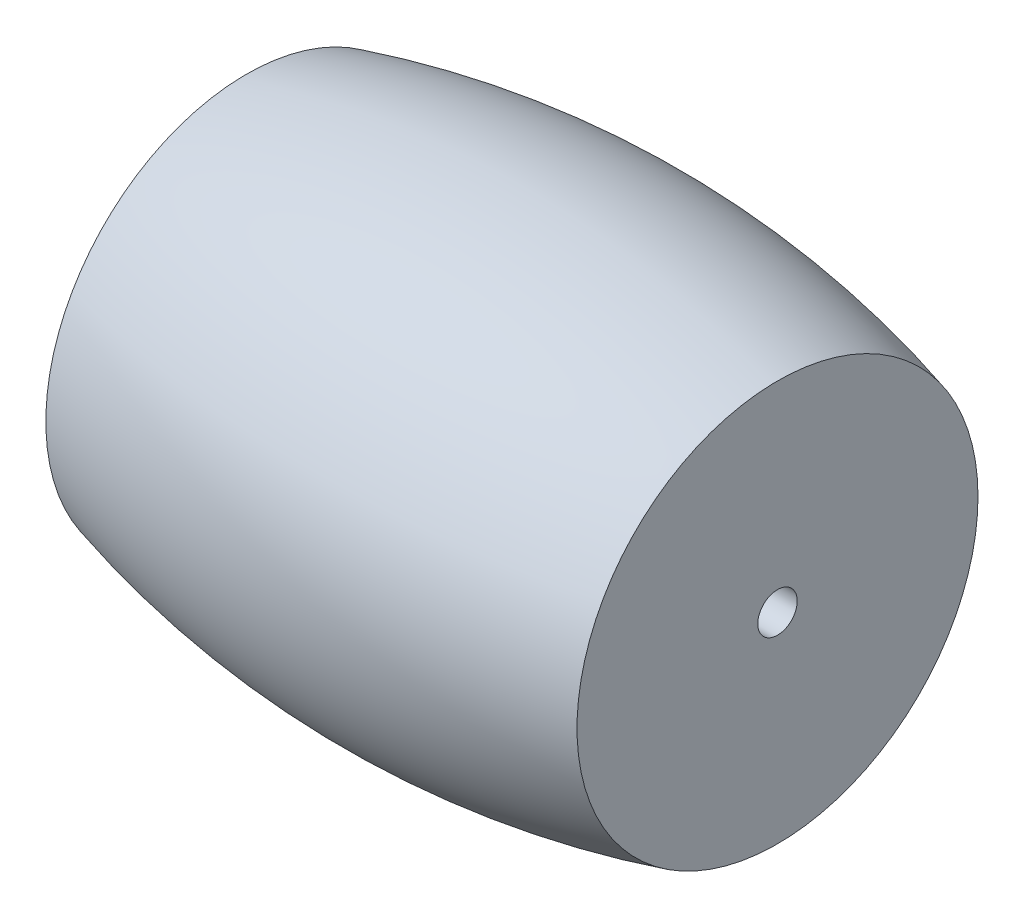
ISO-10303-21;
HEADER;
FILE_DESCRIPTION(('STEP AP214'),'2;1');
FILE_NAME('part.step','',(''),(''),'','','');
FILE_SCHEMA(('AUTOMOTIVE_DESIGN { 1 0 10303 214 1 1 1 1 }'));
ENDSEC;
DATA;
#1=APPLICATION_CONTEXT('core data for automotive mechanical design processes');
#2=APPLICATION_PROTOCOL_DEFINITION('international standard','automotive_design',2000,#1);
#3=PRODUCT_CONTEXT('',#1,'mechanical');
#4=PRODUCT('Part','Part','',(#3));
#5=PRODUCT_RELATED_PRODUCT_CATEGORY('part','',(#4));
#6=PRODUCT_DEFINITION_FORMATION('','',#4);
#7=PRODUCT_DEFINITION_CONTEXT('part definition',#1,'design');
#8=PRODUCT_DEFINITION('design','',#6,#7);
#9=PRODUCT_DEFINITION_SHAPE('','',#8);
#10=(LENGTH_UNIT() NAMED_UNIT(*) SI_UNIT(.MILLI.,.METRE.));
#11=(NAMED_UNIT(*) PLANE_ANGLE_UNIT() SI_UNIT($,.RADIAN.));
#12=(NAMED_UNIT(*) SI_UNIT($,.STERADIAN.) SOLID_ANGLE_UNIT());
#13=UNCERTAINTY_MEASURE_WITH_UNIT(LENGTH_MEASURE(1.E-05),#10,'distance_accuracy_value','');
#14=(GEOMETRIC_REPRESENTATION_CONTEXT(3) GLOBAL_UNCERTAINTY_ASSIGNED_CONTEXT((#13)) GLOBAL_UNIT_ASSIGNED_CONTEXT((#10,
#11,#12)) REPRESENTATION_CONTEXT('',''));
#15=CARTESIAN_POINT('',(0.,0.,0.));
#16=DIRECTION('',(0.,0.,1.));
#17=DIRECTION('',(1.,0.,0.));
#18=AXIS2_PLACEMENT_3D('',#15,#16,#17);
#19=CARTESIAN_POINT('',(27.9669614033673,0.,0.));
#20=DIRECTION('',(1.,0.,0.));
#21=DIRECTION('',(0.,0.,-1.));
#22=AXIS2_PLACEMENT_3D('',#19,#20,#21);
#23=CYLINDRICAL_SURFACE('',#22,1.24999999999999);
#24=CARTESIAN_POINT('',(16.8232379316637,0.,0.));
#25=DIRECTION('',(1.,0.,0.));
#26=DIRECTION('',(0.,0.,-1.));
#27=AXIS2_PLACEMENT_3D('',#24,#25,#26);
#28=CIRCLE('',#27,1.24999999999999);
#29=CARTESIAN_POINT('',(16.8232379316637,0.,-1.24999999999999));
#30=VERTEX_POINT('',#29);
#31=EDGE_CURVE('E10',#30,#30,#28,.T.);
#32=ORIENTED_EDGE('',*,*,#31,.T.);
#33=EDGE_LOOP('',(#32));
#34=FACE_BOUND('',#33,.T.);
#35=CARTESIAN_POINT('',(-16.8232379316637,0.,0.));
#36=DIRECTION('',(1.,0.,0.));
#37=DIRECTION('',(0.,0.,-1.));
#38=AXIS2_PLACEMENT_3D('',#35,#36,#37);
#39=CIRCLE('',#38,1.24999999999999);
#40=CARTESIAN_POINT('',(-16.8232379316637,0.,-1.24999999999999));
#41=VERTEX_POINT('',#40);
#42=EDGE_CURVE('E44',#41,#41,#39,.T.);
#43=ORIENTED_EDGE('',*,*,#42,.F.);
#44=EDGE_LOOP('',(#43));
#45=FACE_BOUND('',#44,.T.);
#46=ADVANCED_FACE('F30',(#34,#45),#23,.F.);
#47=CARTESIAN_POINT('',(16.8232379316637,12.7,0.));
#48=DIRECTION('',(1.,0.,0.));
#49=DIRECTION('',(0.,0.,-1.));
#50=AXIS2_PLACEMENT_3D('',#47,#48,#49);
#51=PLANE('',#50);
#52=CARTESIAN_POINT('',(16.8232379316637,0.,0.));
#53=DIRECTION('',(1.,0.,0.));
#54=DIRECTION('',(0.,0.,-1.));
#55=AXIS2_PLACEMENT_3D('',#52,#53,#54);
#56=CIRCLE('',#55,12.7);
#57=CARTESIAN_POINT('',(16.8232379316637,0.,-12.7));
#58=VERTEX_POINT('',#57);
#59=EDGE_CURVE('E36',#58,#58,#56,.T.);
#60=ORIENTED_EDGE('',*,*,#59,.T.);
#61=EDGE_LOOP('',(#60));
#62=FACE_BOUND('',#61,.T.);
#63=ORIENTED_EDGE('',*,*,#31,.F.);
#64=EDGE_LOOP('',(#63));
#65=FACE_BOUND('',#64,.T.);
#66=ADVANCED_FACE('F54',(#62,#65),#51,.T.);
#67=CARTESIAN_POINT('',(0.,0.,0.));
#68=DIRECTION('',(1.,0.,0.));
#69=DIRECTION('',(0.,0.,-1.));
#70=AXIS2_PLACEMENT_3D('',#67,#68,#69);
#71=DEGENERATE_TOROIDAL_SURFACE('',#70,48.4401980839499,63.4125,.F.);
#72=CARTESIAN_POINT('',(-16.8232379316637,0.,0.));
#73=DIRECTION('',(1.,0.,0.));
#74=DIRECTION('',(0.,0.,-1.));
#75=AXIS2_PLACEMENT_3D('',#72,#73,#74);
#76=CIRCLE('',#75,12.7);
#77=CARTESIAN_POINT('',(-16.8232379316637,0.,-12.7));
#78=VERTEX_POINT('',#77);
#79=EDGE_CURVE('E40',#78,#78,#76,.T.);
#80=ORIENTED_EDGE('',*,*,#79,.T.);
#81=EDGE_LOOP('',(#80));
#82=FACE_BOUND('',#81,.T.);
#83=ORIENTED_EDGE('',*,*,#59,.F.);
#84=EDGE_LOOP('',(#83));
#85=FACE_BOUND('',#84,.T.);
#86=ADVANCED_FACE('F58',(#82,#85),#71,.F.);
#87=CARTESIAN_POINT('',(-16.8232379316637,12.7,0.));
#88=DIRECTION('',(-1.,0.,0.));
#89=DIRECTION('',(0.,0.,1.));
#90=AXIS2_PLACEMENT_3D('',#87,#88,#89);
#91=PLANE('',#90);
#92=ORIENTED_EDGE('',*,*,#42,.T.);
#93=EDGE_LOOP('',(#92));
#94=FACE_BOUND('',#93,.T.);
#95=ORIENTED_EDGE('',*,*,#79,.F.);
#96=EDGE_LOOP('',(#95));
#97=FACE_BOUND('',#96,.T.);
#98=ADVANCED_FACE('F50',(#94,#97),#91,.T.);
#99=CLOSED_SHELL('',(#46,#66,#86,#98));
#100=MANIFOLD_SOLID_BREP('B2',#99);
#101=ADVANCED_BREP_SHAPE_REPRESENTATION('',(#18,#100),#14);
#102=SHAPE_DEFINITION_REPRESENTATION(#9,#101);
ENDSEC;
END-ISO-10303-21;
